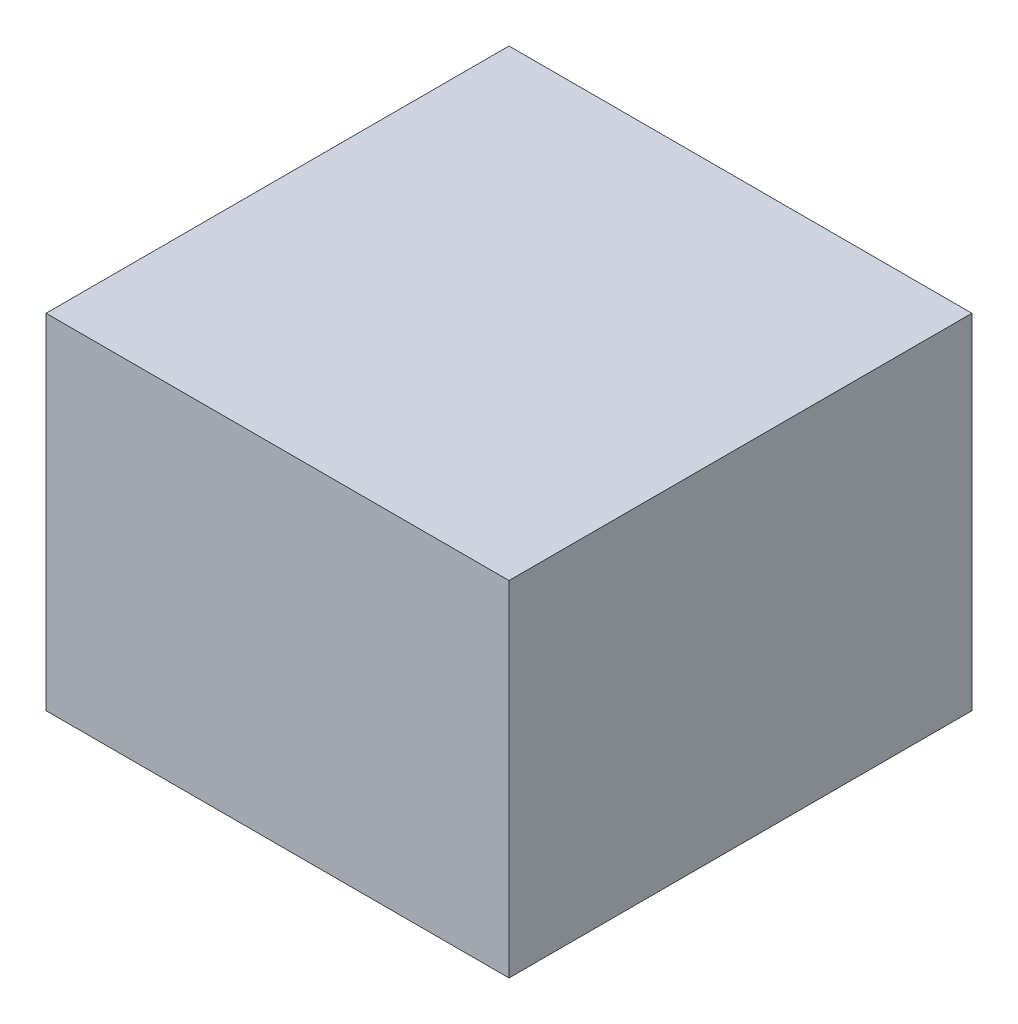
ISO-10303-21;
HEADER;
FILE_DESCRIPTION(('STEP AP214'),'2;1');
FILE_NAME('part.step','',(''),(''),'','','');
FILE_SCHEMA(('AUTOMOTIVE_DESIGN { 1 0 10303 214 1 1 1 1 }'));
ENDSEC;
DATA;
#1=APPLICATION_CONTEXT('core data for automotive mechanical design processes');
#2=APPLICATION_PROTOCOL_DEFINITION('international standard','automotive_design',2000,#1);
#3=PRODUCT_CONTEXT('',#1,'mechanical');
#4=PRODUCT('Part','Part','',(#3));
#5=PRODUCT_RELATED_PRODUCT_CATEGORY('part','',(#4));
#6=PRODUCT_DEFINITION_FORMATION('','',#4);
#7=PRODUCT_DEFINITION_CONTEXT('part definition',#1,'design');
#8=PRODUCT_DEFINITION('design','',#6,#7);
#9=PRODUCT_DEFINITION_SHAPE('','',#8);
#10=(LENGTH_UNIT() NAMED_UNIT(*) SI_UNIT(.MILLI.,.METRE.));
#11=(NAMED_UNIT(*) PLANE_ANGLE_UNIT() SI_UNIT($,.RADIAN.));
#12=(NAMED_UNIT(*) SI_UNIT($,.STERADIAN.) SOLID_ANGLE_UNIT());
#13=UNCERTAINTY_MEASURE_WITH_UNIT(LENGTH_MEASURE(1.E-05),#10,'distance_accuracy_value','');
#14=(GEOMETRIC_REPRESENTATION_CONTEXT(3) GLOBAL_UNCERTAINTY_ASSIGNED_CONTEXT((#13)) GLOBAL_UNIT_ASSIGNED_CONTEXT((#10,
#11,#12)) REPRESENTATION_CONTEXT('',''));
#15=CARTESIAN_POINT('',(0.,0.,0.));
#16=DIRECTION('',(0.,0.,1.));
#17=DIRECTION('',(1.,0.,0.));
#18=AXIS2_PLACEMENT_3D('',#15,#16,#17);
#19=CARTESIAN_POINT('',(0.,11.6,0.));
#20=DIRECTION('',(1.,0.,0.));
#21=DIRECTION('',(0.,0.,-1.));
#22=AXIS2_PLACEMENT_3D('',#19,#20,#21);
#23=PLANE('',#22);
#24=DIRECTION('',(0.,0.,1.));
#25=VECTOR('',#24,1.);
#26=CARTESIAN_POINT('',(0.,0.,0.));
#27=LINE('',#26,#25);
#28=CARTESIAN_POINT('',(0.,0.,-15.6));
#29=VERTEX_POINT('',#28);
#30=CARTESIAN_POINT('',(0.,0.,0.));
#31=VERTEX_POINT('',#30);
#32=EDGE_CURVE('E104',#29,#31,#27,.T.);
#33=ORIENTED_EDGE('',*,*,#32,.T.);
#34=DIRECTION('',(0.,-1.,0.));
#35=VECTOR('',#34,1.);
#36=CARTESIAN_POINT('',(0.,11.6,0.));
#37=LINE('',#36,#35);
#38=CARTESIAN_POINT('',(0.,11.6,0.));
#39=VERTEX_POINT('',#38);
#40=EDGE_CURVE('E11',#39,#31,#37,.T.);
#41=ORIENTED_EDGE('',*,*,#40,.F.);
#42=DIRECTION('',(0.,0.,1.));
#43=VECTOR('',#42,1.);
#44=CARTESIAN_POINT('',(0.,11.6,0.));
#45=LINE('',#44,#43);
#46=CARTESIAN_POINT('',(0.,11.6,-15.6));
#47=VERTEX_POINT('',#46);
#48=EDGE_CURVE('E92',#47,#39,#45,.T.);
#49=ORIENTED_EDGE('',*,*,#48,.F.);
#50=DIRECTION('',(0.,-1.,0.));
#51=VECTOR('',#50,1.);
#52=CARTESIAN_POINT('',(0.,11.6,-15.6));
#53=LINE('',#52,#51);
#54=EDGE_CURVE('E100',#47,#29,#53,.T.);
#55=ORIENTED_EDGE('',*,*,#54,.T.);
#56=EDGE_LOOP('',(#33,#41,#49,#55));
#57=FACE_BOUND('',#56,.T.);
#58=ADVANCED_FACE('F41',(#57),#23,.F.);
#59=CARTESIAN_POINT('',(0.,11.6,0.));
#60=DIRECTION('',(0.,0.,-1.));
#61=DIRECTION('',(-1.,0.,0.));
#62=AXIS2_PLACEMENT_3D('',#59,#60,#61);
#63=PLANE('',#62);
#64=DIRECTION('',(1.,0.,0.));
#65=VECTOR('',#64,1.);
#66=CARTESIAN_POINT('',(0.,0.,0.));
#67=LINE('',#66,#65);
#68=CARTESIAN_POINT('',(15.6,0.,0.));
#69=VERTEX_POINT('',#68);
#70=EDGE_CURVE('E96',#31,#69,#67,.T.);
#71=ORIENTED_EDGE('',*,*,#70,.T.);
#72=DIRECTION('',(0.,-1.,0.));
#73=VECTOR('',#72,1.);
#74=CARTESIAN_POINT('',(15.6,11.6,0.));
#75=LINE('',#74,#73);
#76=CARTESIAN_POINT('',(15.6,11.6,0.));
#77=VERTEX_POINT('',#76);
#78=EDGE_CURVE('E49',#77,#69,#75,.T.);
#79=ORIENTED_EDGE('',*,*,#78,.F.);
#80=DIRECTION('',(1.,0.,0.));
#81=VECTOR('',#80,1.);
#82=CARTESIAN_POINT('',(0.,11.6,0.));
#83=LINE('',#82,#81);
#84=EDGE_CURVE('E87',#39,#77,#83,.T.);
#85=ORIENTED_EDGE('',*,*,#84,.F.);
#86=ORIENTED_EDGE('',*,*,#40,.T.);
#87=EDGE_LOOP('',(#71,#79,#85,#86));
#88=FACE_BOUND('',#87,.T.);
#89=ADVANCED_FACE('F95',(#88),#63,.F.);
#90=CARTESIAN_POINT('',(15.6,11.6,0.));
#91=DIRECTION('',(-1.,0.,0.));
#92=DIRECTION('',(0.,0.,1.));
#93=AXIS2_PLACEMENT_3D('',#90,#91,#92);
#94=PLANE('',#93);
#95=DIRECTION('',(0.,0.,-1.));
#96=VECTOR('',#95,1.);
#97=CARTESIAN_POINT('',(15.6,0.,0.));
#98=LINE('',#97,#96);
#99=CARTESIAN_POINT('',(15.6,0.,-15.6));
#100=VERTEX_POINT('',#99);
#101=EDGE_CURVE('E74',#69,#100,#98,.T.);
#102=ORIENTED_EDGE('',*,*,#101,.T.);
#103=DIRECTION('',(0.,-1.,0.));
#104=VECTOR('',#103,1.);
#105=CARTESIAN_POINT('',(15.6,11.6,-15.6));
#106=LINE('',#105,#104);
#107=CARTESIAN_POINT('',(15.6,11.6,-15.6));
#108=VERTEX_POINT('',#107);
#109=EDGE_CURVE('E97',#108,#100,#106,.T.);
#110=ORIENTED_EDGE('',*,*,#109,.F.);
#111=DIRECTION('',(0.,0.,-1.));
#112=VECTOR('',#111,1.);
#113=CARTESIAN_POINT('',(15.6,11.6,0.));
#114=LINE('',#113,#112);
#115=EDGE_CURVE('E90',#77,#108,#114,.T.);
#116=ORIENTED_EDGE('',*,*,#115,.F.);
#117=ORIENTED_EDGE('',*,*,#78,.T.);
#118=EDGE_LOOP('',(#102,#110,#116,#117));
#119=FACE_BOUND('',#118,.T.);
#120=ADVANCED_FACE('F98',(#119),#94,.F.);
#121=CARTESIAN_POINT('',(0.,11.6,-15.6));
#122=DIRECTION('',(0.,0.,1.));
#123=DIRECTION('',(1.,0.,0.));
#124=AXIS2_PLACEMENT_3D('',#121,#122,#123);
#125=PLANE('',#124);
#126=DIRECTION('',(-1.,0.,0.));
#127=VECTOR('',#126,1.);
#128=CARTESIAN_POINT('',(0.,0.,-15.6));
#129=LINE('',#128,#127);
#130=EDGE_CURVE('E80',#100,#29,#129,.T.);
#131=ORIENTED_EDGE('',*,*,#130,.T.);
#132=ORIENTED_EDGE('',*,*,#54,.F.);
#133=DIRECTION('',(-1.,0.,0.));
#134=VECTOR('',#133,1.);
#135=CARTESIAN_POINT('',(0.,11.6,-15.6));
#136=LINE('',#135,#134);
#137=EDGE_CURVE('E57',#108,#47,#136,.T.);
#138=ORIENTED_EDGE('',*,*,#137,.F.);
#139=ORIENTED_EDGE('',*,*,#109,.T.);
#140=EDGE_LOOP('',(#131,#132,#138,#139));
#141=FACE_BOUND('',#140,.T.);
#142=ADVANCED_FACE('F111',(#141),#125,.F.);
#143=CARTESIAN_POINT('',(0.,11.6,0.));
#144=DIRECTION('',(0.,-1.,0.));
#145=DIRECTION('',(0.,0.,-1.));
#146=AXIS2_PLACEMENT_3D('',#143,#144,#145);
#147=PLANE('',#146);
#148=ORIENTED_EDGE('',*,*,#48,.T.);
#149=ORIENTED_EDGE('',*,*,#84,.T.);
#150=ORIENTED_EDGE('',*,*,#115,.T.);
#151=ORIENTED_EDGE('',*,*,#137,.T.);
#152=EDGE_LOOP('',(#148,#149,#150,#151));
#153=FACE_BOUND('',#152,.T.);
#154=ADVANCED_FACE('F88',(#153),#147,.F.);
#155=CARTESIAN_POINT('',(0.,0.,0.));
#156=DIRECTION('',(0.,-1.,0.));
#157=DIRECTION('',(0.,0.,-1.));
#158=AXIS2_PLACEMENT_3D('',#155,#156,#157);
#159=PLANE('',#158);
#160=ORIENTED_EDGE('',*,*,#32,.F.);
#161=ORIENTED_EDGE('',*,*,#130,.F.);
#162=ORIENTED_EDGE('',*,*,#101,.F.);
#163=ORIENTED_EDGE('',*,*,#70,.F.);
#164=EDGE_LOOP('',(#160,#161,#162,#163));
#165=FACE_BOUND('',#164,.T.);
#166=ADVANCED_FACE('F114',(#165),#159,.T.);
#167=CLOSED_SHELL('',(#58,#89,#120,#142,#154,#166));
#168=MANIFOLD_SOLID_BREP('B2',#167);
#169=ADVANCED_BREP_SHAPE_REPRESENTATION('',(#18,#168),#14);
#170=SHAPE_DEFINITION_REPRESENTATION(#9,#169);
ENDSEC;
END-ISO-10303-21;
